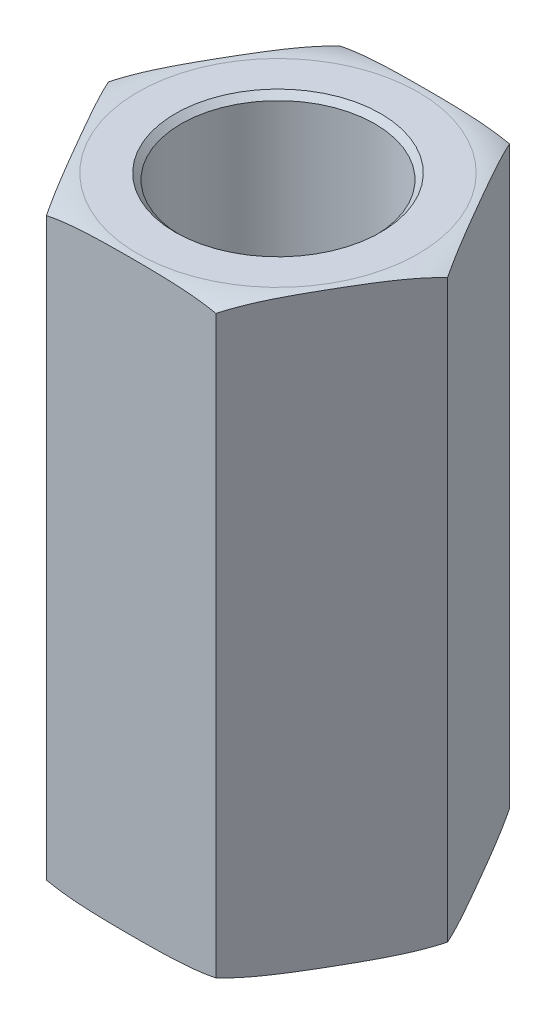
ISO-10303-21;
HEADER;
FILE_DESCRIPTION(('STEP AP214'),'2;1');
FILE_NAME('part.step','',(''),(''),'','','');
FILE_SCHEMA(('AUTOMOTIVE_DESIGN { 1 0 10303 214 1 1 1 1 }'));
ENDSEC;
DATA;
#1=APPLICATION_CONTEXT('core data for automotive mechanical design processes');
#2=APPLICATION_PROTOCOL_DEFINITION('international standard','automotive_design',2000,#1);
#3=PRODUCT_CONTEXT('',#1,'mechanical');
#4=PRODUCT('Part','Part','',(#3));
#5=PRODUCT_RELATED_PRODUCT_CATEGORY('part','',(#4));
#6=PRODUCT_DEFINITION_FORMATION('','',#4);
#7=PRODUCT_DEFINITION_CONTEXT('part definition',#1,'design');
#8=PRODUCT_DEFINITION('design','',#6,#7);
#9=PRODUCT_DEFINITION_SHAPE('','',#8);
#10=(LENGTH_UNIT() NAMED_UNIT(*) SI_UNIT(.MILLI.,.METRE.));
#11=(NAMED_UNIT(*) PLANE_ANGLE_UNIT() SI_UNIT($,.RADIAN.));
#12=(NAMED_UNIT(*) SI_UNIT($,.STERADIAN.) SOLID_ANGLE_UNIT());
#13=UNCERTAINTY_MEASURE_WITH_UNIT(LENGTH_MEASURE(1.E-05),#10,'distance_accuracy_value','');
#14=(GEOMETRIC_REPRESENTATION_CONTEXT(3) GLOBAL_UNCERTAINTY_ASSIGNED_CONTEXT((#13)) GLOBAL_UNIT_ASSIGNED_CONTEXT((#10,
#11,#12)) REPRESENTATION_CONTEXT('',''));
#15=CARTESIAN_POINT('',(0.,0.,0.));
#16=DIRECTION('',(0.,0.,1.));
#17=DIRECTION('',(1.,0.,0.));
#18=AXIS2_PLACEMENT_3D('',#15,#16,#17);
#19=CARTESIAN_POINT('',(3.66617420935412,6.35,0.));
#20=DIRECTION('',(-0.866025403784439,0.,-0.5));
#21=DIRECTION('',(0.5,0.,-0.866025403784439));
#22=AXIS2_PLACEMENT_3D('',#19,#20,#21);
#23=PLANE('',#22);
#24=CARTESIAN_POINT('',(3.66617420935412,6.223,0.));
#25=CARTESIAN_POINT('',(3.63753042799203,6.23493202468709,0.0496124846400273));
#26=CARTESIAN_POINT('',(3.60875945805375,6.24555614694223,0.0994452663561575));
#27=CARTESIAN_POINT('',(3.5510445941875,6.26452869380446,0.199410342924434));
#28=CARTESIAN_POINT('',(3.52210079717004,6.27287829008084,0.249542469922636));
#29=CARTESIAN_POINT('',(3.43520914920621,6.29501015084215,0.400043218949385));
#30=CARTESIAN_POINT('',(3.37708055050429,6.30592253839952,0.500724905273883));
#31=CARTESIAN_POINT('',(3.26070078255249,6.3225474670846,0.70230057633948));
#32=CARTESIAN_POINT('',(3.20244972255356,6.32826351393611,0.803194371852365));
#33=CARTESIAN_POINT('',(3.08586365366197,6.33654325238667,1.00512736662734));
#34=CARTESIAN_POINT('',(3.02752861562773,6.3391051045623,1.1061666163641));
#35=CARTESIAN_POINT('',(2.9113821383228,6.3424800878033,1.30733821617637));
#36=CARTESIAN_POINT('',(2.85357078573452,6.34330898530758,1.40747041611356));
#37=CARTESIAN_POINT('',(2.73795502274299,6.34390235146376,1.60772279177073));
#38=CARTESIAN_POINT('',(2.68015061252641,6.34366697200316,1.70784296716739));
#39=CARTESIAN_POINT('',(2.5645271384304,6.34193398748164,1.90810869884931));
#40=CARTESIAN_POINT('',(2.50670807591217,6.34043597123025,2.0082542527769));
#41=CARTESIAN_POINT('',(2.39109525560101,6.33517531674577,2.20850153156215));
#42=CARTESIAN_POINT('',(2.33330149587797,6.33141290136093,2.30860325976288));
#43=CARTESIAN_POINT('',(2.23849359853911,6.32198899303816,2.47281535491257));
#44=CARTESIAN_POINT('',(2.20145192539195,6.31749057663767,2.53697341480081));
#45=CARTESIAN_POINT('',(2.12747060706784,6.30630148199487,2.66511281694908));
#46=CARTESIAN_POINT('',(2.09053091530161,6.2996120720916,2.72909423990413));
#47=CARTESIAN_POINT('',(2.01669860633929,6.28339780386583,2.85697555026699));
#48=CARTESIAN_POINT('',(1.97980639337021,6.27386525006224,2.92087473753309));
#49=CARTESIAN_POINT('',(1.90623831426152,6.25126291445617,3.04829838836459));
#50=CARTESIAN_POINT('',(1.86956287153406,6.23818767878213,3.11182211855863));
#51=CARTESIAN_POINT('',(1.83308710467706,6.223,3.175));
#52=B_SPLINE_CURVE_WITH_KNOTS('',3,(#24,#25,#26,#27,#28,#29,#30,#31,#32,#33,#34,#35,#36,#37,#38,
#39,#40,#41,#42,#43,#44,#45,#46,#47,#48,#49,#50,#51),.UNSPECIFIED.,.F.,.F.,(4,2,2,2,2,2,2,2,2,2,
2,2,2,4),(0.,0.17550946738822,0.350928353443244,0.701031261588485,1.05089779629355,
1.40096826525493,1.74783967758032,2.09466158796882,2.44159648808704,2.78849725058545,
3.01113198199941,3.23363806003512,3.45675194236245,3.68021127402553),.UNSPECIFIED.);
#53=CARTESIAN_POINT('',(3.66617420935412,6.223,0.));
#54=VERTEX_POINT('',#53);
#55=CARTESIAN_POINT('',(1.83308710467706,6.223,3.175));
#56=VERTEX_POINT('',#55);
#57=EDGE_CURVE('E126',#54,#56,#52,.T.);
#58=ORIENTED_EDGE('',*,*,#57,.T.);
#59=DIRECTION('',(0.,1.,0.));
#60=VECTOR('',#59,1.);
#61=CARTESIAN_POINT('',(1.83308710467704,6.35,3.175));
#62=LINE('',#61,#60);
#63=CARTESIAN_POINT('',(1.83308710467705,-6.223,3.175));
#64=VERTEX_POINT('',#63);
#65=EDGE_CURVE('E130',#64,#56,#62,.T.);
#66=ORIENTED_EDGE('',*,*,#65,.F.);
#67=CARTESIAN_POINT('',(1.83308710467705,-6.223,3.17500000000001));
#68=CARTESIAN_POINT('',(1.86173088603914,-6.23493202468708,3.12538751535998));
#69=CARTESIAN_POINT('',(1.89050185597742,-6.24555614694223,3.07555473364384));
#70=CARTESIAN_POINT('',(1.94821671984368,-6.26452869380445,2.97558965707556));
#71=CARTESIAN_POINT('',(1.97716051686114,-6.27287829008084,2.92545753007736));
#72=CARTESIAN_POINT('',(2.06405216482497,-6.29501015084215,2.77495678105061));
#73=CARTESIAN_POINT('',(2.12218076352689,-6.30592253839952,2.67427509472611));
#74=CARTESIAN_POINT('',(2.2385605314787,-6.3225474670846,2.4726994236605));
#75=CARTESIAN_POINT('',(2.29681159147762,-6.32826351393611,2.37180562814761));
#76=CARTESIAN_POINT('',(2.41339766036922,-6.33654325238667,2.16987263337264));
#77=CARTESIAN_POINT('',(2.47173269840347,-6.3391051045623,2.06883338363586));
#78=CARTESIAN_POINT('',(2.58787917570839,-6.3424800878033,1.86766178382359));
#79=CARTESIAN_POINT('',(2.64569052829668,-6.34330898530758,1.7675295838864));
#80=CARTESIAN_POINT('',(2.76130629128821,-6.34390235146376,1.56727720822922));
#81=CARTESIAN_POINT('',(2.81911070150479,-6.34366697200316,1.46715703283255));
#82=CARTESIAN_POINT('',(2.93473417560081,-6.34193398748164,1.26689130115063));
#83=CARTESIAN_POINT('',(2.99255323811904,-6.34043597123025,1.16674574722304));
#84=CARTESIAN_POINT('',(3.1081660584302,-6.33517531674576,0.966498468437779));
#85=CARTESIAN_POINT('',(3.16595981815325,-6.33141290136092,0.866396740237043));
#86=CARTESIAN_POINT('',(3.26076771549211,-6.32198899303815,0.702184645087361));
#87=CARTESIAN_POINT('',(3.29780938863927,-6.31749057663767,0.638026585199124));
#88=CARTESIAN_POINT('',(3.37179070696336,-6.30630148199486,0.509887183050866));
#89=CARTESIAN_POINT('',(3.40873039872959,-6.2996120720916,0.445905760095823));
#90=CARTESIAN_POINT('',(3.4825627076919,-6.28339780386583,0.318024449732975));
#91=CARTESIAN_POINT('',(3.51945492066098,-6.27386525006224,0.254125262466882));
#92=CARTESIAN_POINT('',(3.59302299976966,-6.25126291445617,0.126701611635399));
#93=CARTESIAN_POINT('',(3.62969844249711,-6.23818767878213,0.0631778814413663));
#94=CARTESIAN_POINT('',(3.66617420935412,-6.223,0.));
#95=B_SPLINE_CURVE_WITH_KNOTS('',3,(#67,#68,#69,#70,#71,#72,#73,#74,#75,#76,#77,#78,#79,#80,#81,
#82,#83,#84,#85,#86,#87,#88,#89,#90,#91,#92,#93,#94),.UNSPECIFIED.,.F.,.F.,(4,2,2,2,2,2,2,2,2,2,
2,2,2,4),(0.,0.175509467388227,0.350928353443257,0.701031261588509,1.05089779629358,
1.40096826525498,1.74783967758038,2.09466158796889,2.44159648808712,2.78849725058554,
3.01113198199948,3.23363806003517,3.45675194236248,3.68021127402553),.UNSPECIFIED.);
#96=CARTESIAN_POINT('',(3.66617420935412,-6.223,0.));
#97=VERTEX_POINT('',#96);
#98=EDGE_CURVE('E115',#64,#97,#95,.T.);
#99=ORIENTED_EDGE('',*,*,#98,.T.);
#100=DIRECTION('',(0.,1.,0.));
#101=VECTOR('',#100,1.);
#102=CARTESIAN_POINT('',(3.66617420935412,6.35,0.));
#103=LINE('',#102,#101);
#104=EDGE_CURVE('E120',#54,#97,#103,.F.);
#105=ORIENTED_EDGE('',*,*,#104,.F.);
#106=EDGE_LOOP('',(#58,#66,#99,#105));
#107=FACE_BOUND('',#106,.T.);
#108=ADVANCED_FACE('F37',(#107),#23,.F.);
#109=CARTESIAN_POINT('',(1.83308710467706,6.35,-3.17499999999999));
#110=DIRECTION('',(-0.866025403784439,0.,0.5));
#111=DIRECTION('',(-0.5,0.,-0.866025403784439));
#112=AXIS2_PLACEMENT_3D('',#109,#110,#111);
#113=PLANE('',#112);
#114=CARTESIAN_POINT('',(1.83308710467706,6.223,-3.17499999999999));
#115=CARTESIAN_POINT('',(1.86173088603915,6.23493202468709,-3.12538751535996));
#116=CARTESIAN_POINT('',(1.89050185597743,6.24555614694223,-3.07555473364383));
#117=CARTESIAN_POINT('',(1.94821671984368,6.26452869380446,-2.97558965707556));
#118=CARTESIAN_POINT('',(1.97716051686114,6.27287829008084,-2.92545753007736));
#119=CARTESIAN_POINT('',(2.06405216482498,6.29501015084215,-2.77495678105061));
#120=CARTESIAN_POINT('',(2.12218076352689,6.30592253839952,-2.67427509472611));
#121=CARTESIAN_POINT('',(2.23856053147869,6.3225474670846,-2.47269942366051));
#122=CARTESIAN_POINT('',(2.29681159147762,6.32826351393611,-2.37180562814763));
#123=CARTESIAN_POINT('',(2.41339766036922,6.33654325238667,-2.16987263337266));
#124=CARTESIAN_POINT('',(2.47173269840346,6.3391051045623,-2.06883338363589));
#125=CARTESIAN_POINT('',(2.58787917570838,6.3424800878033,-1.86766178382362));
#126=CARTESIAN_POINT('',(2.64569052829666,6.34330898530758,-1.76752958388643));
#127=CARTESIAN_POINT('',(2.76130629128819,6.34390235146376,-1.56727720822926));
#128=CARTESIAN_POINT('',(2.81911070150477,6.34366697200316,-1.46715703283259));
#129=CARTESIAN_POINT('',(2.93473417560078,6.34193398748164,-1.26689130115068));
#130=CARTESIAN_POINT('',(2.99255323811902,6.34043597123025,-1.16674574722309));
#131=CARTESIAN_POINT('',(3.10816605843017,6.33517531674577,-0.966498468437838));
#132=CARTESIAN_POINT('',(3.16595981815321,6.33141290136093,-0.866396740237105));
#133=CARTESIAN_POINT('',(3.26076771549208,6.32198899303816,-0.702184645087422));
#134=CARTESIAN_POINT('',(3.29780938863924,6.31749057663767,-0.638026585199181));
#135=CARTESIAN_POINT('',(3.37179070696334,6.30630148199487,-0.509887183050912));
#136=CARTESIAN_POINT('',(3.40873039872957,6.2996120720916,-0.445905760095864));
#137=CARTESIAN_POINT('',(3.48256270769189,6.28339780386583,-0.318024449733006));
#138=CARTESIAN_POINT('',(3.51945492066097,6.27386525006224,-0.254125262466908));
#139=CARTESIAN_POINT('',(3.59302299976965,6.25126291445617,-0.126701611635414));
#140=CARTESIAN_POINT('',(3.62969844249711,6.23818767878213,-0.0631778814413764));
#141=CARTESIAN_POINT('',(3.66617420935412,6.223,0.));
#142=B_SPLINE_CURVE_WITH_KNOTS('',3,(#114,#115,#116,#117,#118,#119,#120,#121,#122,#123,#124,
#125,#126,#127,#128,#129,#130,#131,#132,#133,#134,#135,#136,#137,#138,#139,#140,#141),
.UNSPECIFIED.,.F.,.F.,(4,2,2,2,2,2,2,2,2,2,2,2,2,4),(0.,0.175509467388221,0.350928353443245,
0.701031261588486,1.05089779629355,1.40096826525493,1.74783967758032,2.09466158796882,
2.44159648808704,2.78849725058545,3.0111319819994,3.23363806003511,3.45675194236244,
3.68021127402551),.UNSPECIFIED.);
#143=CARTESIAN_POINT('',(1.83308710467706,6.223,-3.17499999999999));
#144=VERTEX_POINT('',#143);
#145=EDGE_CURVE('E42',#144,#54,#142,.T.);
#146=ORIENTED_EDGE('',*,*,#145,.T.);
#147=ORIENTED_EDGE('',*,*,#104,.T.);
#148=CARTESIAN_POINT('',(3.66617420935412,-6.223,0.));
#149=CARTESIAN_POINT('',(3.63753042799203,-6.23493202468709,-0.0496124846400355));
#150=CARTESIAN_POINT('',(3.60875945805375,-6.24555614694223,-0.0994452663561683));
#151=CARTESIAN_POINT('',(3.55104459418749,-6.26452869380446,-0.19941034292445));
#152=CARTESIAN_POINT('',(3.52210079717003,-6.27287829008084,-0.249542469922655));
#153=CARTESIAN_POINT('',(3.43520914920619,-6.29501015084215,-0.400043218949413));
#154=CARTESIAN_POINT('',(3.37708055050427,-6.30592253839952,-0.500724905273916));
#155=CARTESIAN_POINT('',(3.26070078255247,-6.3225474670846,-0.702300576339523));
#156=CARTESIAN_POINT('',(3.20244972255354,-6.32826351393611,-0.803194371852414));
#157=CARTESIAN_POINT('',(3.08586365366193,-6.33654325238667,-1.0051273666274));
#158=CARTESIAN_POINT('',(3.02752861562769,-6.3391051045623,-1.10616661636417));
#159=CARTESIAN_POINT('',(2.91138213832276,-6.3424800878033,-1.30733821617645));
#160=CARTESIAN_POINT('',(2.85357078573448,-6.34330898530758,-1.40747041611364));
#161=CARTESIAN_POINT('',(2.73795502274294,-6.34390235146376,-1.60772279177082));
#162=CARTESIAN_POINT('',(2.68015061252636,-6.34366697200316,-1.70784296716749));
#163=CARTESIAN_POINT('',(2.56452713843034,-6.34193398748164,-1.90810869884942));
#164=CARTESIAN_POINT('',(2.5067080759121,-6.34043597123025,-2.00825425277701));
#165=CARTESIAN_POINT('',(2.39109525560094,-6.33517531674576,-2.20850153156228));
#166=CARTESIAN_POINT('',(2.3333014958779,-6.33141290136092,-2.30860325976302));
#167=CARTESIAN_POINT('',(2.23849359853904,-6.32198899303815,-2.47281535491269));
#168=CARTESIAN_POINT('',(2.20145192539188,-6.31749057663766,-2.53697341480092));
#169=CARTESIAN_POINT('',(2.1274706070678,-6.30630148199486,-2.66511281694917));
#170=CARTESIAN_POINT('',(2.09053091530157,-6.29961207209159,-2.72909423990421));
#171=CARTESIAN_POINT('',(2.01669860633926,-6.28339780386582,-2.85697555026704));
#172=CARTESIAN_POINT('',(1.97980639337019,-6.27386525006223,-2.92087473753313));
#173=CARTESIAN_POINT('',(1.90623831426151,-6.25126291445617,-3.0482983883646));
#174=CARTESIAN_POINT('',(1.86956287153406,-6.23818767878213,-3.11182211855863));
#175=CARTESIAN_POINT('',(1.83308710467706,-6.223,-3.17499999999999));
#176=B_SPLINE_CURVE_WITH_KNOTS('',3,(#148,#149,#150,#151,#152,#153,#154,#155,#156,#157,#158,
#159,#160,#161,#162,#163,#164,#165,#166,#167,#168,#169,#170,#171,#172,#173,#174,#175),
.UNSPECIFIED.,.F.,.F.,(4,2,2,2,2,2,2,2,2,2,2,2,2,4),(0.,0.17550946738823,0.350928353443263,
0.701031261588523,1.0508977962936,1.40096826525501,1.74783967758041,2.09466158796894,
2.44159648808717,2.7884972505856,3.01113198199951,3.23363806003518,3.45675194236248,
3.68021127402551),.UNSPECIFIED.);
#177=CARTESIAN_POINT('',(1.83308710467706,-6.223,-3.17499999999999));
#178=VERTEX_POINT('',#177);
#179=EDGE_CURVE('E119',#97,#178,#176,.T.);
#180=ORIENTED_EDGE('',*,*,#179,.T.);
#181=DIRECTION('',(0.,1.,0.));
#182=VECTOR('',#181,1.);
#183=CARTESIAN_POINT('',(1.83308710467706,6.35,-3.17499999999999));
#184=LINE('',#183,#182);
#185=EDGE_CURVE('E109',#144,#178,#184,.F.);
#186=ORIENTED_EDGE('',*,*,#185,.F.);
#187=EDGE_LOOP('',(#146,#147,#180,#186));
#188=FACE_BOUND('',#187,.T.);
#189=ADVANCED_FACE('F118',(#188),#113,.F.);
#190=CARTESIAN_POINT('',(-1.83308710467707,6.35,-3.175));
#191=DIRECTION('',(0.,0.,1.));
#192=DIRECTION('',(-1.,0.,0.));
#193=AXIS2_PLACEMENT_3D('',#190,#191,#192);
#194=PLANE('',#193);
#195=ORIENTED_EDGE('',*,*,#185,.T.);
#196=CARTESIAN_POINT('',(1.83308710467706,-6.223,-3.17499999999999));
#197=CARTESIAN_POINT('',(1.75760871054776,-6.23871230122365,-3.17499999999999));
#198=CARTESIAN_POINT('',(1.68170571468658,-6.25216478008081,-3.17499999999999));
#199=CARTESIAN_POINT('',(1.52939807527773,-6.27530486470105,-3.17499999999999));
#200=CARTESIAN_POINT('',(1.45299400110163,-6.28499617502722,-3.17499999999999));
#201=CARTESIAN_POINT('',(1.30011823209763,-6.30137135267139,-3.17499999999999));
#202=CARTESIAN_POINT('',(1.22364747610196,-6.30806442247852,-3.17499999999999));
#203=CARTESIAN_POINT('',(1.07052459410172,-6.31917241699752,-3.17499999999999));
#204=CARTESIAN_POINT('',(0.993872424115954,-6.32358671655425,-3.17499999999999));
#205=CARTESIAN_POINT('',(0.840856910195844,-6.33072419802799,-3.17499999999999));
#206=CARTESIAN_POINT('',(0.76449391332928,-6.33345527367792,-3.17499999999999));
#207=CARTESIAN_POINT('',(0.611734616938515,-6.33775632258003,-3.17499999999999));
#208=CARTESIAN_POINT('',(0.535338316331408,-6.33932625473883,-3.17499999999999));
#209=CARTESIAN_POINT('',(0.382454231226419,-6.34168247076568,-3.17499999999999));
#210=CARTESIAN_POINT('',(0.305966435115038,-6.34246792759644,-3.17499999999999));
#211=CARTESIAN_POINT('',(0.152985759387012,-6.34348841069004,-3.17499999999999));
#212=CARTESIAN_POINT('',(0.0764928796935062,-6.3437234241492,-3.175));
#213=CARTESIAN_POINT('',(-0.076492879693506,-6.3437234241492,-3.175));
#214=CARTESIAN_POINT('',(-0.152985759387012,-6.34348841069004,-3.175));
#215=CARTESIAN_POINT('',(-0.305966435115038,-6.34246792759644,-3.175));
#216=CARTESIAN_POINT('',(-0.382454231226419,-6.34168247076568,-3.175));
#217=CARTESIAN_POINT('',(-0.535338316331408,-6.33932625473883,-3.175));
#218=CARTESIAN_POINT('',(-0.611734616938515,-6.33775632258003,-3.175));
#219=CARTESIAN_POINT('',(-0.76449391332928,-6.33345527367792,-3.175));
#220=CARTESIAN_POINT('',(-0.840856910195844,-6.33072419802798,-3.175));
#221=CARTESIAN_POINT('',(-0.993872424115955,-6.32358671655425,-3.175));
#222=CARTESIAN_POINT('',(-1.07052459410172,-6.31917241699752,-3.175));
#223=CARTESIAN_POINT('',(-1.22364747610196,-6.30806442247852,-3.175));
#224=CARTESIAN_POINT('',(-1.30011823209763,-6.30137135267139,-3.175));
#225=CARTESIAN_POINT('',(-1.45299400110163,-6.28499617502722,-3.175));
#226=CARTESIAN_POINT('',(-1.52939807527773,-6.27530486470105,-3.175));
#227=CARTESIAN_POINT('',(-1.68170571468658,-6.2521647800808,-3.175));
#228=CARTESIAN_POINT('',(-1.75760871054776,-6.23871230122365,-3.175));
#229=CARTESIAN_POINT('',(-1.83308710467706,-6.223,-3.175));
#230=B_SPLINE_CURVE_WITH_KNOTS('',3,(#196,#197,#198,#199,#200,#201,#202,#203,#204,#205,#206,
#207,#208,#209,#210,#211,#212,#213,#214,#215,#216,#217,#218,#219,#220,#221,#222,#223,#224,#225,
#226,#227,#228,#229),.UNSPECIFIED.,.F.,.F.,(4,2,2,2,2,2,2,2,2,2,2,2,2,2,2,2,4),(0.,
0.23119079437731,0.462153295935889,0.692401964780502,0.92271376624805,1.15193709952407,
1.3811685447265,1.61064140410055,1.84011960111016,2.06959779811977,2.29907065749383,
2.52830210269625,2.75752543597227,2.98783723743982,3.21808590628443,3.44904840784301,
3.68023920222032),.UNSPECIFIED.);
#231=CARTESIAN_POINT('',(-1.83308710467707,-6.223,-3.175));
#232=VERTEX_POINT('',#231);
#233=EDGE_CURVE('E218',#178,#232,#230,.T.);
#234=ORIENTED_EDGE('',*,*,#233,.T.);
#235=DIRECTION('',(0.,1.,0.));
#236=VECTOR('',#235,1.);
#237=CARTESIAN_POINT('',(-1.83308710467707,6.35,-3.175));
#238=LINE('',#237,#236);
#239=CARTESIAN_POINT('',(-1.83308710467707,6.223,-3.175));
#240=VERTEX_POINT('',#239);
#241=EDGE_CURVE('E112',#240,#232,#238,.F.);
#242=ORIENTED_EDGE('',*,*,#241,.F.);
#243=CARTESIAN_POINT('',(-1.83308710467707,6.223,-3.175));
#244=CARTESIAN_POINT('',(-1.75760871054776,6.23871230122365,-3.175));
#245=CARTESIAN_POINT('',(-1.68170571468658,6.2521647800808,-3.175));
#246=CARTESIAN_POINT('',(-1.52939807527773,6.27530486470105,-3.175));
#247=CARTESIAN_POINT('',(-1.45299400110163,6.28499617502722,-3.175));
#248=CARTESIAN_POINT('',(-1.30011823209763,6.30137135267138,-3.175));
#249=CARTESIAN_POINT('',(-1.22364747610196,6.30806442247852,-3.175));
#250=CARTESIAN_POINT('',(-1.07052459410173,6.31917241699752,-3.175));
#251=CARTESIAN_POINT('',(-0.993872424115957,6.32358671655425,-3.175));
#252=CARTESIAN_POINT('',(-0.840856910195846,6.33072419802798,-3.175));
#253=CARTESIAN_POINT('',(-0.764493913329282,6.33345527367792,-3.175));
#254=CARTESIAN_POINT('',(-0.611734616938516,6.33775632258003,-3.175));
#255=CARTESIAN_POINT('',(-0.535338316331409,6.33932625473883,-3.175));
#256=CARTESIAN_POINT('',(-0.38245423122642,6.34168247076567,-3.175));
#257=CARTESIAN_POINT('',(-0.305966435115039,6.34246792759644,-3.175));
#258=CARTESIAN_POINT('',(-0.152985759387013,6.34348841069004,-3.175));
#259=CARTESIAN_POINT('',(-0.0764928796935063,6.3437234241492,-3.175));
#260=CARTESIAN_POINT('',(0.0764928796935061,6.3437234241492,-3.175));
#261=CARTESIAN_POINT('',(0.152985759387012,6.34348841069004,-3.17499999999999));
#262=CARTESIAN_POINT('',(0.305966435115038,6.34246792759644,-3.17499999999999));
#263=CARTESIAN_POINT('',(0.382454231226419,6.34168247076567,-3.17499999999999));
#264=CARTESIAN_POINT('',(0.535338316331408,6.33932625473883,-3.17499999999999));
#265=CARTESIAN_POINT('',(0.611734616938515,6.33775632258003,-3.17499999999999));
#266=CARTESIAN_POINT('',(0.76449391332928,6.33345527367792,-3.17499999999999));
#267=CARTESIAN_POINT('',(0.840856910195844,6.33072419802798,-3.17499999999999));
#268=CARTESIAN_POINT('',(0.993872424115954,6.32358671655425,-3.17499999999999));
#269=CARTESIAN_POINT('',(1.07052459410172,6.31917241699752,-3.17499999999999));
#270=CARTESIAN_POINT('',(1.22364747610196,6.30806442247852,-3.17499999999999));
#271=CARTESIAN_POINT('',(1.30011823209763,6.30137135267139,-3.17499999999999));
#272=CARTESIAN_POINT('',(1.45299400110163,6.28499617502722,-3.17499999999999));
#273=CARTESIAN_POINT('',(1.52939807527773,6.27530486470105,-3.17499999999999));
#274=CARTESIAN_POINT('',(1.68170571468658,6.25216478008081,-3.17499999999999));
#275=CARTESIAN_POINT('',(1.75760871054776,6.23871230122365,-3.17499999999999));
#276=CARTESIAN_POINT('',(1.83308710467706,6.223,-3.17499999999999));
#277=B_SPLINE_CURVE_WITH_KNOTS('',3,(#243,#244,#245,#246,#247,#248,#249,#250,#251,#252,#253,
#254,#255,#256,#257,#258,#259,#260,#261,#262,#263,#264,#265,#266,#267,#268,#269,#270,#271,#272,
#273,#274,#275,#276),.UNSPECIFIED.,.F.,.F.,(4,2,2,2,2,2,2,2,2,2,2,2,2,2,2,2,4),(0.,
0.23119079437731,0.46215329593589,0.692401964780505,0.922713766248053,1.15193709952408,
1.3811685447265,1.61064140410055,1.84011960111017,2.06959779811978,2.29907065749383,
2.52830210269625,2.75752543597228,2.98783723743982,3.21808590628444,3.44904840784302,
3.68023920222033),.UNSPECIFIED.);
#278=EDGE_CURVE('E106',#240,#144,#277,.T.);
#279=ORIENTED_EDGE('',*,*,#278,.T.);
#280=EDGE_LOOP('',(#195,#234,#242,#279));
#281=FACE_BOUND('',#280,.T.);
#282=ADVANCED_FACE('F107',(#281),#194,.F.);
#283=CARTESIAN_POINT('',(-3.66617420935413,6.35,0.));
#284=DIRECTION('',(0.866025403784439,0.,0.499999999999999));
#285=DIRECTION('',(-0.499999999999999,0.,0.866025403784439));
#286=AXIS2_PLACEMENT_3D('',#283,#284,#285);
#287=PLANE('',#286);
#288=CARTESIAN_POINT('',(-3.66617420935412,6.223,0.));
#289=CARTESIAN_POINT('',(-3.63753042799204,6.23493202468708,-0.0496124846400287));
#290=CARTESIAN_POINT('',(-3.60875945805376,6.24555614694223,-0.0994452663561603));
#291=CARTESIAN_POINT('',(-3.5510445941875,6.26452869380446,-0.199410342924439));
#292=CARTESIAN_POINT('',(-3.52210079717004,6.27287829008084,-0.249542469922643));
#293=CARTESIAN_POINT('',(-3.43520914920621,6.29501015084215,-0.400043218949397));
#294=CARTESIAN_POINT('',(-3.37708055050429,6.30592253839952,-0.500724905273897));
#295=CARTESIAN_POINT('',(-3.26070078255249,6.3225474670846,-0.702300576339499));
#296=CARTESIAN_POINT('',(-3.20244972255356,6.32826351393611,-0.803194371852387));
#297=CARTESIAN_POINT('',(-3.08586365366196,6.33654325238667,-1.00512736662736));
#298=CARTESIAN_POINT('',(-3.02752861562771,6.3391051045623,-1.10616661636413));
#299=CARTESIAN_POINT('',(-2.91138213832279,6.3424800878033,-1.30733821617641));
#300=CARTESIAN_POINT('',(-2.85357078573451,6.34330898530758,-1.4074704161136));
#301=CARTESIAN_POINT('',(-2.73795502274297,6.34390235146376,-1.60772279177078));
#302=CARTESIAN_POINT('',(-2.68015061252639,6.34366697200316,-1.70784296716744));
#303=CARTESIAN_POINT('',(-2.56452713843038,6.34193398748164,-1.90810869884937));
#304=CARTESIAN_POINT('',(-2.50670807591214,6.34043597123025,-2.00825425277695));
#305=CARTESIAN_POINT('',(-2.39109525560098,6.33517531674576,-2.20850153156221));
#306=CARTESIAN_POINT('',(-2.33330149587794,6.33141290136092,-2.30860325976295));
#307=CARTESIAN_POINT('',(-2.23849359853908,6.32198899303815,-2.47281535491263));
#308=CARTESIAN_POINT('',(-2.20145192539192,6.31749057663767,-2.53697341480087));
#309=CARTESIAN_POINT('',(-2.12747060706783,6.30630148199486,-2.66511281694913));
#310=CARTESIAN_POINT('',(-2.0905309153016,6.2996120720916,-2.72909423990417));
#311=CARTESIAN_POINT('',(-2.01669860633929,6.28339780386583,-2.85697555026702));
#312=CARTESIAN_POINT('',(-1.97980639337021,6.27386525006224,-2.92087473753311));
#313=CARTESIAN_POINT('',(-1.90623831426153,6.25126291445617,-3.0482983883646));
#314=CARTESIAN_POINT('',(-1.86956287153407,6.23818767878213,-3.11182211855863));
#315=CARTESIAN_POINT('',(-1.83308710467707,6.223,-3.175));
#316=B_SPLINE_CURVE_WITH_KNOTS('',3,(#288,#289,#290,#291,#292,#293,#294,#295,#296,#297,#298,
#299,#300,#301,#302,#303,#304,#305,#306,#307,#308,#309,#310,#311,#312,#313,#314,#315),
.UNSPECIFIED.,.F.,.F.,(4,2,2,2,2,2,2,2,2,2,2,2,2,4),(0.,0.175509467388225,0.350928353443254,
0.701031261588504,1.05089779629357,1.40096826525497,1.74783967758037,2.09466158796888,
2.44159648808711,2.78849725058552,3.01113198199946,3.23363806003515,3.45675194236247,
3.68021127402552),.UNSPECIFIED.);
#317=CARTESIAN_POINT('',(-3.66617420935413,6.223,0.));
#318=VERTEX_POINT('',#317);
#319=EDGE_CURVE('E116',#318,#240,#316,.T.);
#320=ORIENTED_EDGE('',*,*,#319,.T.);
#321=ORIENTED_EDGE('',*,*,#241,.T.);
#322=CARTESIAN_POINT('',(-1.83308710467707,-6.223,-3.175));
#323=CARTESIAN_POINT('',(-1.86173088603915,-6.23493202468708,-3.12538751535997));
#324=CARTESIAN_POINT('',(-1.89050185597743,-6.24555614694223,-3.07555473364384));
#325=CARTESIAN_POINT('',(-1.94821671984368,-6.26452869380445,-2.97558965707557));
#326=CARTESIAN_POINT('',(-1.97716051686114,-6.27287829008083,-2.92545753007737));
#327=CARTESIAN_POINT('',(-2.06405216482498,-6.29501015084215,-2.77495678105062));
#328=CARTESIAN_POINT('',(-2.12218076352689,-6.30592253839952,-2.67427509472613));
#329=CARTESIAN_POINT('',(-2.23856053147869,-6.3225474670846,-2.47269942366053));
#330=CARTESIAN_POINT('',(-2.29681159147761,-6.32826351393611,-2.37180562814765));
#331=CARTESIAN_POINT('',(-2.41339766036921,-6.33654325238667,-2.16987263337269));
#332=CARTESIAN_POINT('',(-2.47173269840345,-6.3391051045623,-2.06883338363592));
#333=CARTESIAN_POINT('',(-2.58787917570836,-6.3424800878033,-1.86766178382365));
#334=CARTESIAN_POINT('',(-2.64569052829664,-6.34330898530758,-1.76752958388647));
#335=CARTESIAN_POINT('',(-2.76130629128817,-6.34390235146376,-1.5672772082293));
#336=CARTESIAN_POINT('',(-2.81911070150475,-6.34366697200316,-1.46715703283264));
#337=CARTESIAN_POINT('',(-2.93473417560076,-6.34193398748164,-1.26689130115073));
#338=CARTESIAN_POINT('',(-2.99255323811899,-6.34043597123025,-1.16674574722315));
#339=CARTESIAN_POINT('',(-3.10816605843015,-6.33517531674577,-0.966498468437894));
#340=CARTESIAN_POINT('',(-3.16595981815318,-6.33141290136093,-0.866396740237163));
#341=CARTESIAN_POINT('',(-3.26076771549205,-6.32198899303816,-0.702184645087477));
#342=CARTESIAN_POINT('',(-3.29780938863921,-6.31749057663768,-0.63802658519923));
#343=CARTESIAN_POINT('',(-3.37179070696332,-6.30630148199487,-0.509887183050951));
#344=CARTESIAN_POINT('',(-3.40873039872955,-6.29961207209161,-0.445905760095898));
#345=CARTESIAN_POINT('',(-3.48256270769188,-6.28339780386583,-0.318024449733029));
#346=CARTESIAN_POINT('',(-3.51945492066096,-6.27386525006224,-0.254125262466926));
#347=CARTESIAN_POINT('',(-3.59302299976965,-6.25126291445617,-0.126701611635421));
#348=CARTESIAN_POINT('',(-3.62969844249711,-6.23818767878213,-0.0631778814413781));
#349=CARTESIAN_POINT('',(-3.66617420935412,-6.223,0.));
#350=B_SPLINE_CURVE_WITH_KNOTS('',3,(#322,#323,#324,#325,#326,#327,#328,#329,#330,#331,#332,
#333,#334,#335,#336,#337,#338,#339,#340,#341,#342,#343,#344,#345,#346,#347,#348,#349),
.UNSPECIFIED.,.F.,.F.,(4,2,2,2,2,2,2,2,2,2,2,2,2,4),(0.,0.175509467388216,0.350928353443237,
0.701031261588471,1.05089779629352,1.4009682652549,1.74783967758028,2.09466158796878,
2.44159648808698,2.78849725058539,3.01113198199936,3.23363806003508,3.45675194236244,
3.68021127402552),.UNSPECIFIED.);
#351=CARTESIAN_POINT('',(-3.66617420935413,-6.223,0.));
#352=VERTEX_POINT('',#351);
#353=EDGE_CURVE('E212',#232,#352,#350,.T.);
#354=ORIENTED_EDGE('',*,*,#353,.T.);
#355=DIRECTION('',(0.,1.,0.));
#356=VECTOR('',#355,1.);
#357=CARTESIAN_POINT('',(-3.66617420935413,6.35,0.));
#358=LINE('',#357,#356);
#359=EDGE_CURVE('E136',#318,#352,#358,.F.);
#360=ORIENTED_EDGE('',*,*,#359,.F.);
#361=EDGE_LOOP('',(#320,#321,#354,#360));
#362=FACE_BOUND('',#361,.T.);
#363=ADVANCED_FACE('F206',(#362),#287,.F.);
#364=CARTESIAN_POINT('',(-1.83308710467707,6.35,3.175));
#365=DIRECTION('',(0.866025403784439,0.,-0.5));
#366=DIRECTION('',(0.5,0.,0.866025403784439));
#367=AXIS2_PLACEMENT_3D('',#364,#365,#366);
#368=PLANE('',#367);
#369=CARTESIAN_POINT('',(-1.83308710467706,6.223,3.17500000000001));
#370=CARTESIAN_POINT('',(-1.86173088603915,6.23493202468708,3.12538751535998));
#371=CARTESIAN_POINT('',(-1.89050185597743,6.24555614694223,3.07555473364385));
#372=CARTESIAN_POINT('',(-1.94821671984368,6.26452869380445,2.97558965707557));
#373=CARTESIAN_POINT('',(-1.97716051686114,6.27287829008083,2.92545753007737));
#374=CARTESIAN_POINT('',(-2.06405216482498,6.29501015084215,2.77495678105062));
#375=CARTESIAN_POINT('',(-2.12218076352689,6.30592253839952,2.67427509472612));
#376=CARTESIAN_POINT('',(-2.2385605314787,6.3225474670846,2.47269942366052));
#377=CARTESIAN_POINT('',(-2.29681159147762,6.32826351393611,2.37180562814763));
#378=CARTESIAN_POINT('',(-2.41339766036922,6.33654325238667,2.16987263337266));
#379=CARTESIAN_POINT('',(-2.47173269840346,6.3391051045623,2.06883338363589));
#380=CARTESIAN_POINT('',(-2.58787917570839,6.3424800878033,1.86766178382362));
#381=CARTESIAN_POINT('',(-2.64569052829667,6.34330898530758,1.76752958388643));
#382=CARTESIAN_POINT('',(-2.7613062912882,6.34390235146376,1.56727720822926));
#383=CARTESIAN_POINT('',(-2.81911070150478,6.34366697200316,1.46715703283259));
#384=CARTESIAN_POINT('',(-2.93473417560079,6.34193398748164,1.26689130115067));
#385=CARTESIAN_POINT('',(-2.99255323811903,6.34043597123025,1.16674574722309));
#386=CARTESIAN_POINT('',(-3.10816605843019,6.33517531674577,0.966498468437829));
#387=CARTESIAN_POINT('',(-3.16595981815323,6.33141290136093,0.866396740237095));
#388=CARTESIAN_POINT('',(-3.26076771549209,6.32198899303815,0.702184645087411));
#389=CARTESIAN_POINT('',(-3.29780938863925,6.31749057663767,0.63802658519917));
#390=CARTESIAN_POINT('',(-3.37179070696335,6.30630148199487,0.509887183050903));
#391=CARTESIAN_POINT('',(-3.40873039872958,6.2996120720916,0.445905760095856));
#392=CARTESIAN_POINT('',(-3.4825627076919,6.28339780386583,0.318024449733));
#393=CARTESIAN_POINT('',(-3.51945492066098,6.27386525006224,0.254125262466903));
#394=CARTESIAN_POINT('',(-3.59302299976966,6.25126291445617,0.126701611635411));
#395=CARTESIAN_POINT('',(-3.62969844249712,6.23818767878213,0.0631778814413743));
#396=CARTESIAN_POINT('',(-3.66617420935413,6.223,0.));
#397=B_SPLINE_CURVE_WITH_KNOTS('',3,(#369,#370,#371,#372,#373,#374,#375,#376,#377,#378,#379,
#380,#381,#382,#383,#384,#385,#386,#387,#388,#389,#390,#391,#392,#393,#394,#395,#396),
.UNSPECIFIED.,.F.,.F.,(4,2,2,2,2,2,2,2,2,2,2,2,2,4),(0.,0.175509467388222,0.350928353443249,
0.701031261588494,1.05089779629356,1.40096826525495,1.74783967758034,2.09466158796885,
2.44159648808707,2.78849725058548,3.01113198199943,3.23363806003514,3.45675194236247,
3.68021127402553),.UNSPECIFIED.);
#398=CARTESIAN_POINT('',(-1.83308710467706,6.223,3.175));
#399=VERTEX_POINT('',#398);
#400=EDGE_CURVE('E182',#399,#318,#397,.T.);
#401=ORIENTED_EDGE('',*,*,#400,.T.);
#402=ORIENTED_EDGE('',*,*,#359,.T.);
#403=CARTESIAN_POINT('',(-3.66617420935413,-6.223,0.));
#404=CARTESIAN_POINT('',(-3.63753042799204,-6.23493202468708,0.049612484640031));
#405=CARTESIAN_POINT('',(-3.60875945805377,-6.24555614694223,0.0994452663561602));
#406=CARTESIAN_POINT('',(-3.55104459418751,-6.26452869380445,0.199410342924434));
#407=CARTESIAN_POINT('',(-3.52210079717005,-6.27287829008083,0.249542469922636));
#408=CARTESIAN_POINT('',(-3.43520914920622,-6.29501015084215,0.400043218949382));
#409=CARTESIAN_POINT('',(-3.37708055050431,-6.30592253839952,0.500724905273878));
#410=CARTESIAN_POINT('',(-3.26070078255251,-6.3225474670846,0.70230057633947));
#411=CARTESIAN_POINT('',(-3.20244972255358,-6.32826351393611,0.803194371852353));
#412=CARTESIAN_POINT('',(-3.08586365366199,-6.33654325238667,1.00512736662732));
#413=CARTESIAN_POINT('',(-3.02752861562775,-6.3391051045623,1.10616661636409));
#414=CARTESIAN_POINT('',(-2.91138213832283,-6.3424800878033,1.30733821617635));
#415=CARTESIAN_POINT('',(-2.85357078573455,-6.34330898530758,1.40747041611353));
#416=CARTESIAN_POINT('',(-2.73795502274302,-6.34390235146376,1.6077227917707));
#417=CARTESIAN_POINT('',(-2.68015061252644,-6.34366697200316,1.70784296716737));
#418=CARTESIAN_POINT('',(-2.56452713843043,-6.34193398748164,1.90810869884928));
#419=CARTESIAN_POINT('',(-2.5067080759122,-6.34043597123025,2.00825425277686));
#420=CARTESIAN_POINT('',(-2.39109525560104,-6.33517531674577,2.20850153156211));
#421=CARTESIAN_POINT('',(-2.333301495878,-6.33141290136093,2.30860325976284));
#422=CARTESIAN_POINT('',(-2.23849359853914,-6.32198899303816,2.47281535491253));
#423=CARTESIAN_POINT('',(-2.20145192539198,-6.31749057663768,2.53697341480078));
#424=CARTESIAN_POINT('',(-2.12747060706787,-6.30630148199487,2.66511281694906));
#425=CARTESIAN_POINT('',(-2.09053091530164,-6.29961207209161,2.72909423990411));
#426=CARTESIAN_POINT('',(-2.01669860633931,-6.28339780386583,2.85697555026698));
#427=CARTESIAN_POINT('',(-1.97980639337023,-6.27386525006224,2.92087473753308));
#428=CARTESIAN_POINT('',(-1.90623831426154,-6.25126291445617,3.04829838836458));
#429=CARTESIAN_POINT('',(-1.86956287153408,-6.23818767878213,3.11182211855862));
#430=CARTESIAN_POINT('',(-1.83308710467707,-6.223,3.175));
#431=B_SPLINE_CURVE_WITH_KNOTS('',3,(#403,#404,#405,#406,#407,#408,#409,#410,#411,#412,#413,
#414,#415,#416,#417,#418,#419,#420,#421,#422,#423,#424,#425,#426,#427,#428,#429,#430),
.UNSPECIFIED.,.F.,.F.,(4,2,2,2,2,2,2,2,2,2,2,2,2,4),(0.,0.175509467388217,0.350928353443238,
0.701031261588472,1.05089779629353,1.40096826525491,1.74783967758028,2.09466158796878,
2.44159648808699,2.78849725058539,3.01113198199936,3.23363806003509,3.45675194236244,
3.68021127402552),.UNSPECIFIED.);
#432=CARTESIAN_POINT('',(-1.83308710467707,-6.223,3.175));
#433=VERTEX_POINT('',#432);
#434=EDGE_CURVE('E160',#352,#433,#431,.T.);
#435=ORIENTED_EDGE('',*,*,#434,.T.);
#436=DIRECTION('',(0.,1.,0.));
#437=VECTOR('',#436,1.);
#438=CARTESIAN_POINT('',(-1.83308710467706,6.35,3.175));
#439=LINE('',#438,#437);
#440=EDGE_CURVE('E127',#399,#433,#439,.F.);
#441=ORIENTED_EDGE('',*,*,#440,.F.);
#442=EDGE_LOOP('',(#401,#402,#435,#441));
#443=FACE_BOUND('',#442,.T.);
#444=ADVANCED_FACE('F170',(#443),#368,.F.);
#445=CARTESIAN_POINT('',(1.83308710467706,6.35,3.175));
#446=DIRECTION('',(0.,0.,-1.));
#447=DIRECTION('',(1.,0.,0.));
#448=AXIS2_PLACEMENT_3D('',#445,#446,#447);
#449=PLANE('',#448);
#450=CARTESIAN_POINT('',(1.83308710467706,6.223,3.175));
#451=CARTESIAN_POINT('',(1.75760871054775,6.23871230122365,3.175));
#452=CARTESIAN_POINT('',(1.68170571468657,6.2521647800808,3.175));
#453=CARTESIAN_POINT('',(1.52939807527772,6.27530486470105,3.175));
#454=CARTESIAN_POINT('',(1.45299400110162,6.28499617502722,3.175));
#455=CARTESIAN_POINT('',(1.30011823209763,6.30137135267138,3.175));
#456=CARTESIAN_POINT('',(1.22364747610195,6.30806442247852,3.175));
#457=CARTESIAN_POINT('',(1.07052459410172,6.31917241699751,3.175));
#458=CARTESIAN_POINT('',(0.99387242411595,6.32358671655425,3.175));
#459=CARTESIAN_POINT('',(0.840856910195841,6.33072419802798,3.175));
#460=CARTESIAN_POINT('',(0.764493913329277,6.33345527367791,3.175));
#461=CARTESIAN_POINT('',(0.611734616938512,6.33775632258003,3.175));
#462=CARTESIAN_POINT('',(0.535338316331406,6.33932625473883,3.175));
#463=CARTESIAN_POINT('',(0.382454231226418,6.34168247076567,3.175));
#464=CARTESIAN_POINT('',(0.305966435115037,6.34246792759644,3.175));
#465=CARTESIAN_POINT('',(0.152985759387012,6.34348841069004,3.175));
#466=CARTESIAN_POINT('',(0.0764928796935061,6.3437234241492,3.175));
#467=CARTESIAN_POINT('',(-0.0764928796935053,6.3437234241492,3.175));
#468=CARTESIAN_POINT('',(-0.152985759387011,6.34348841069004,3.175));
#469=CARTESIAN_POINT('',(-0.305966435115036,6.34246792759644,3.175));
#470=CARTESIAN_POINT('',(-0.382454231226417,6.34168247076567,3.175));
#471=CARTESIAN_POINT('',(-0.535338316331405,6.33932625473883,3.175));
#472=CARTESIAN_POINT('',(-0.611734616938511,6.33775632258003,3.175));
#473=CARTESIAN_POINT('',(-0.764493913329276,6.33345527367791,3.175));
#474=CARTESIAN_POINT('',(-0.84085691019584,6.33072419802798,3.175));
#475=CARTESIAN_POINT('',(-0.99387242411595,6.32358671655425,3.175));
#476=CARTESIAN_POINT('',(-1.07052459410172,6.31917241699751,3.175));
#477=CARTESIAN_POINT('',(-1.22364747610195,6.30806442247852,3.175));
#478=CARTESIAN_POINT('',(-1.30011823209763,6.30137135267138,3.175));
#479=CARTESIAN_POINT('',(-1.45299400110163,6.28499617502722,3.175));
#480=CARTESIAN_POINT('',(-1.52939807527772,6.27530486470105,3.175));
#481=CARTESIAN_POINT('',(-1.68170571468657,6.2521647800808,3.175));
#482=CARTESIAN_POINT('',(-1.75760871054775,6.23871230122365,3.175));
#483=CARTESIAN_POINT('',(-1.83308710467706,6.223,3.175));
#484=B_SPLINE_CURVE_WITH_KNOTS('',3,(#450,#451,#452,#453,#454,#455,#456,#457,#458,#459,#460,
#461,#462,#463,#464,#465,#466,#467,#468,#469,#470,#471,#472,#473,#474,#475,#476,#477,#478,#479,
#480,#481,#482,#483),.UNSPECIFIED.,.F.,.F.,(4,2,2,2,2,2,2,2,2,2,2,2,2,2,2,2,4),(0.,
0.231190794377309,0.462153295935887,0.6924019647805,0.922713766248047,1.15193709952407,
1.38116854472649,1.61064140410054,1.84011960111015,2.06959779811976,2.29907065749382,
2.52830210269624,2.75752543597226,2.98783723743981,3.21808590628442,3.449048407843,
3.68023920222031),.UNSPECIFIED.);
#485=EDGE_CURVE('E128',#56,#399,#484,.T.);
#486=ORIENTED_EDGE('',*,*,#485,.T.);
#487=ORIENTED_EDGE('',*,*,#440,.T.);
#488=CARTESIAN_POINT('',(-1.83308710467707,-6.22299999999999,3.175));
#489=CARTESIAN_POINT('',(-1.75760871054776,-6.23871230122365,3.175));
#490=CARTESIAN_POINT('',(-1.68170571468658,-6.2521647800808,3.175));
#491=CARTESIAN_POINT('',(-1.52939807527773,-6.27530486470104,3.175));
#492=CARTESIAN_POINT('',(-1.45299400110163,-6.28499617502722,3.175));
#493=CARTESIAN_POINT('',(-1.30011823209763,-6.30137135267138,3.175));
#494=CARTESIAN_POINT('',(-1.22364747610196,-6.30806442247852,3.175));
#495=CARTESIAN_POINT('',(-1.07052459410173,-6.31917241699751,3.175));
#496=CARTESIAN_POINT('',(-0.993872424115956,-6.32358671655425,3.175));
#497=CARTESIAN_POINT('',(-0.840856910195845,-6.33072419802798,3.175));
#498=CARTESIAN_POINT('',(-0.764493913329281,-6.33345527367792,3.175));
#499=CARTESIAN_POINT('',(-0.611734616938516,-6.33775632258003,3.175));
#500=CARTESIAN_POINT('',(-0.535338316331409,-6.33932625473883,3.175));
#501=CARTESIAN_POINT('',(-0.38245423122642,-6.34168247076567,3.175));
#502=CARTESIAN_POINT('',(-0.305966435115039,-6.34246792759644,3.175));
#503=CARTESIAN_POINT('',(-0.152985759387013,-6.34348841069004,3.175));
#504=CARTESIAN_POINT('',(-0.0764928796935066,-6.3437234241492,3.175));
#505=CARTESIAN_POINT('',(0.0764928796935049,-6.3437234241492,3.175));
#506=CARTESIAN_POINT('',(0.15298575938701,-6.34348841069004,3.175));
#507=CARTESIAN_POINT('',(0.305966435115035,-6.34246792759644,3.175));
#508=CARTESIAN_POINT('',(0.382454231226416,-6.34168247076567,3.175));
#509=CARTESIAN_POINT('',(0.535338316331403,-6.33932625473883,3.175));
#510=CARTESIAN_POINT('',(0.611734616938509,-6.33775632258003,3.175));
#511=CARTESIAN_POINT('',(0.764493913329273,-6.33345527367792,3.175));
#512=CARTESIAN_POINT('',(0.840856910195836,-6.33072419802798,3.175));
#513=CARTESIAN_POINT('',(0.993872424115945,-6.32358671655425,3.175));
#514=CARTESIAN_POINT('',(1.07052459410171,-6.31917241699752,3.175));
#515=CARTESIAN_POINT('',(1.22364747610195,-6.30806442247852,3.175));
#516=CARTESIAN_POINT('',(1.30011823209762,-6.30137135267138,3.175));
#517=CARTESIAN_POINT('',(1.45299400110162,-6.28499617502722,3.175));
#518=CARTESIAN_POINT('',(1.52939807527771,-6.27530486470105,3.175));
#519=CARTESIAN_POINT('',(1.68170571468656,-6.25216478008081,3.175));
#520=CARTESIAN_POINT('',(1.75760871054774,-6.23871230122365,3.175));
#521=CARTESIAN_POINT('',(1.83308710467705,-6.223,3.175));
#522=B_SPLINE_CURVE_WITH_KNOTS('',3,(#488,#489,#490,#491,#492,#493,#494,#495,#496,#497,#498,
#499,#500,#501,#502,#503,#504,#505,#506,#507,#508,#509,#510,#511,#512,#513,#514,#515,#516,#517,
#518,#519,#520,#521),.UNSPECIFIED.,.F.,.F.,(4,2,2,2,2,2,2,2,2,2,2,2,2,2,2,2,4),(0.,
0.23119079437731,0.46215329593589,0.692401964780504,0.922713766248052,1.15193709952407,
1.3811685447265,1.61064140410055,1.84011960111016,2.06959779811977,2.29907065749383,
2.52830210269625,2.75752543597227,2.98783723743981,3.21808590628442,3.449048407843,
3.68023920222031),.UNSPECIFIED.);
#523=EDGE_CURVE('E154',#433,#64,#522,.T.);
#524=ORIENTED_EDGE('',*,*,#523,.T.);
#525=ORIENTED_EDGE('',*,*,#65,.T.);
#526=EDGE_LOOP('',(#486,#487,#524,#525));
#527=FACE_BOUND('',#526,.T.);
#528=ADVANCED_FACE('F166',(#527),#449,.F.);
#529=CARTESIAN_POINT('',(0.,4.69899999999995,0.));
#530=DIRECTION('',(0.,1.,0.));
#531=DIRECTION('',(0.,0.,-1.));
#532=AXIS2_PLACEMENT_3D('',#529,#530,#531);
#533=TOROIDAL_SURFACE('',#532,3.03117420935412,1.65100000000005);
#534=ORIENTED_EDGE('',*,*,#57,.F.);
#535=ORIENTED_EDGE('',*,*,#145,.F.);
#536=ORIENTED_EDGE('',*,*,#278,.F.);
#537=ORIENTED_EDGE('',*,*,#319,.F.);
#538=ORIENTED_EDGE('',*,*,#400,.F.);
#539=ORIENTED_EDGE('',*,*,#485,.F.);
#540=EDGE_LOOP('',(#534,#535,#536,#537,#538,#539));
#541=FACE_BOUND('',#540,.T.);
#542=CARTESIAN_POINT('',(0.,6.35,0.));
#543=DIRECTION('',(0.,-1.,0.));
#544=DIRECTION('',(0.,0.,-1.));
#545=AXIS2_PLACEMENT_3D('',#542,#543,#544);
#546=CIRCLE('',#545,3.03117420935412);
#547=CARTESIAN_POINT('',(0.,6.35,-3.03117420935412));
#548=VERTEX_POINT('',#547);
#549=EDGE_CURVE('E150',#548,#548,#546,.F.);
#550=ORIENTED_EDGE('',*,*,#549,.F.);
#551=EDGE_LOOP('',(#550));
#552=FACE_BOUND('',#551,.T.);
#553=ADVANCED_FACE('F123',(#541,#552),#533,.T.);
#554=CARTESIAN_POINT('',(0.,-4.69899999999999,0.));
#555=DIRECTION('',(0.,-1.,0.));
#556=DIRECTION('',(0.,0.,1.));
#557=AXIS2_PLACEMENT_3D('',#554,#555,#556);
#558=TOROIDAL_SURFACE('',#557,3.03117420935412,1.65100000000001);
#559=CARTESIAN_POINT('',(0.,-6.35,3.03117420935412));
#560=CARTESIAN_POINT('',(0.578424743720693,-6.35,3.03088455919606));
#561=CARTESIAN_POINT('',(1.11575919022366,-6.35,2.81835031833962));
#562=CARTESIAN_POINT('',(1.69861585330176,-6.35,2.58781047630709));
#563=CARTESIAN_POINT('',(2.14336383839209,-6.35,2.14336383839205));
#564=CARTESIAN_POINT('',(2.58666814314654,-6.35,1.70035990262072));
#565=CARTESIAN_POINT('',(2.81835031833963,-6.35,1.11575919022362));
#566=CARTESIAN_POINT('',(3.0309784255278,-6.35,0.579237367453916));
#567=CARTESIAN_POINT('',(3.03117420935412,-6.35,0.));
#568=CARTESIAN_POINT('',(3.03136930427548,-6.35,-0.577199203712815));
#569=CARTESIAN_POINT('',(2.81835031833961,-6.35,-1.11575919022367));
#570=CARTESIAN_POINT('',(2.58781047292779,-6.35,-1.69861585668335));
#571=CARTESIAN_POINT('',(2.14336383839205,-6.35,-2.14336383839208));
#572=CARTESIAN_POINT('',(1.70035990262036,-6.35,-2.58666814314691));
#573=CARTESIAN_POINT('',(1.11575919022363,-6.35,-2.81835031833962));
#574=CARTESIAN_POINT('',(0.579475106659534,-6.35,-3.03088420748249));
#575=CARTESIAN_POINT('',(0.,-6.35,-3.03117420935412));
#576=B_SPLINE_CURVE_WITH_KNOTS('',2,(#559,#560,#561,#562,#563,#564,#565,#566,#567,#568,#569,
#570,#571,#572,#573,#574,#575),.UNSPECIFIED.,.F.,.F.,(3,2,2,2,2,2,2,2,3),(0.,0.125,0.25,0.375,
0.5,0.625,0.75,0.875,1.),.UNSPECIFIED.);
#577=CARTESIAN_POINT('',(0.,-6.35,3.03117420935412));
#578=VERTEX_POINT('',#577);
#579=CARTESIAN_POINT('',(0.,-6.35,-3.03117420935412));
#580=VERTEX_POINT('',#579);
#581=EDGE_CURVE('E153',#578,#580,#576,.T.);
#582=ORIENTED_EDGE('',*,*,#581,.T.);
#583=CARTESIAN_POINT('',(0.,-6.35,-3.03117420935412));
#584=CARTESIAN_POINT('',(-0.578424743720748,-6.35,-3.03088455919583));
#585=CARTESIAN_POINT('',(-1.11575919022365,-6.35,-2.81835031833962));
#586=CARTESIAN_POINT('',(-1.69861585329917,-6.35,-2.58781047630835));
#587=CARTESIAN_POINT('',(-2.14336383839207,-6.35,-2.14336383839206));
#588=CARTESIAN_POINT('',(-2.58666814314576,-6.35,-1.70035990262283));
#589=CARTESIAN_POINT('',(-2.81835031833962,-6.35,-1.11575919022364));
#590=CARTESIAN_POINT('',(-3.03097842552755,-6.35,-0.579237367454385));
#591=CARTESIAN_POINT('',(-3.03117420935412,-6.35,0.));
#592=CARTESIAN_POINT('',(-3.03136930427572,-6.35,0.577199203710298));
#593=CARTESIAN_POINT('',(-2.81835031833962,-6.35,1.11575919022364));
#594=CARTESIAN_POINT('',(-2.58781047292967,-6.35,1.69861585668067));
#595=CARTESIAN_POINT('',(-2.14336383839207,-6.35,2.14336383839207));
#596=CARTESIAN_POINT('',(-1.70035990262195,-6.35,2.58666814314612));
#597=CARTESIAN_POINT('',(-1.11575919022364,-6.35,2.81835031833962));
#598=CARTESIAN_POINT('',(-0.579475106660494,-6.35,3.03088420748225));
#599=CARTESIAN_POINT('',(0.,-6.35,3.03117420935412));
#600=B_SPLINE_CURVE_WITH_KNOTS('',2,(#583,#584,#585,#586,#587,#588,#589,#590,#591,#592,#593,
#594,#595,#596,#597,#598,#599),.UNSPECIFIED.,.F.,.F.,(3,2,2,2,2,2,2,2,3),(0.,0.125,0.25,0.375,
0.5,0.625,0.75,0.875,1.),.UNSPECIFIED.);
#601=EDGE_CURVE('E61',#580,#578,#600,.T.);
#602=ORIENTED_EDGE('',*,*,#601,.T.);
#603=EDGE_LOOP('',(#582,#602));
#604=FACE_BOUND('',#603,.T.);
#605=ORIENTED_EDGE('',*,*,#434,.F.);
#606=ORIENTED_EDGE('',*,*,#353,.F.);
#607=ORIENTED_EDGE('',*,*,#233,.F.);
#608=ORIENTED_EDGE('',*,*,#179,.F.);
#609=ORIENTED_EDGE('',*,*,#98,.F.);
#610=ORIENTED_EDGE('',*,*,#523,.F.);
#611=EDGE_LOOP('',(#605,#606,#607,#608,#609,#610));
#612=FACE_BOUND('',#611,.T.);
#613=ADVANCED_FACE('F39',(#604,#612),#558,.T.);
#614=CARTESIAN_POINT('',(-1.83308710467707,6.35,3.175));
#615=DIRECTION('',(0.,-1.,0.));
#616=DIRECTION('',(0.,0.,1.));
#617=AXIS2_PLACEMENT_3D('',#614,#615,#616);
#618=PLANE('',#617);
#619=CARTESIAN_POINT('',(0.,6.34999999994079,0.));
#620=DIRECTION('',(0.,-1.,0.));
#621=DIRECTION('',(0.,0.,-1.));
#622=AXIS2_PLACEMENT_3D('',#619,#620,#621);
#623=CIRCLE('',#622,2.22249999990254);
#624=CARTESIAN_POINT('',(0.,6.34999999994079,-2.22249999990254));
#625=VERTEX_POINT('',#624);
#626=EDGE_CURVE('E147',#625,#625,#623,.F.);
#627=ORIENTED_EDGE('',*,*,#626,.F.);
#628=EDGE_LOOP('',(#627));
#629=FACE_BOUND('',#628,.T.);
#630=ORIENTED_EDGE('',*,*,#549,.T.);
#631=EDGE_LOOP('',(#630));
#632=FACE_BOUND('',#631,.T.);
#633=ADVANCED_FACE('F171',(#629,#632),#618,.F.);
#634=CARTESIAN_POINT('',(-1.83308710467707,-6.35,3.175));
#635=DIRECTION('',(0.,-1.,0.));
#636=DIRECTION('',(0.,0.,1.));
#637=AXIS2_PLACEMENT_3D('',#634,#635,#636);
#638=PLANE('',#637);
#639=CARTESIAN_POINT('',(0.,-6.34999999994079,0.));
#640=DIRECTION('',(0.,1.,0.));
#641=DIRECTION('',(0.,0.,1.));
#642=AXIS2_PLACEMENT_3D('',#639,#640,#641);
#643=CIRCLE('',#642,2.22249999990254);
#644=CARTESIAN_POINT('',(0.,-6.34999999994079,2.22249999990254));
#645=VERTEX_POINT('',#644);
#646=EDGE_CURVE('E144',#645,#645,#643,.F.);
#647=ORIENTED_EDGE('',*,*,#646,.F.);
#648=EDGE_LOOP('',(#647));
#649=FACE_BOUND('',#648,.T.);
#650=ORIENTED_EDGE('',*,*,#581,.F.);
#651=ORIENTED_EDGE('',*,*,#601,.F.);
#652=EDGE_LOOP('',(#650,#651));
#653=FACE_BOUND('',#652,.T.);
#654=ADVANCED_FACE('F271',(#649,#653),#638,.T.);
#655=CARTESIAN_POINT('',(0.,6.34999999988395,0.));
#656=DIRECTION('',(0.,1.,0.));
#657=DIRECTION('',(0.,0.,-1.));
#658=AXIS2_PLACEMENT_3D('',#655,#656,#657);
#659=CONICAL_SURFACE('',#658,2.2224999998457,0.785398163397448);
#660=ORIENTED_EDGE('',*,*,#626,.T.);
#661=EDGE_LOOP('',(#660));
#662=FACE_BOUND('',#661,.T.);
#663=CARTESIAN_POINT('',(0.,6.223,0.));
#664=DIRECTION('',(0.,-1.,0.));
#665=DIRECTION('',(0.,0.,-1.));
#666=AXIS2_PLACEMENT_3D('',#663,#664,#665);
#667=CIRCLE('',#666,2.0955);
#668=CARTESIAN_POINT('',(0.,6.223,-2.0955));
#669=VERTEX_POINT('',#668);
#670=EDGE_CURVE('E53',#669,#669,#667,.F.);
#671=ORIENTED_EDGE('',*,*,#670,.F.);
#672=EDGE_LOOP('',(#671));
#673=FACE_BOUND('',#672,.T.);
#674=ADVANCED_FACE('F278',(#662,#673),#659,.F.);
#675=CARTESIAN_POINT('',(0.,-6.34999999982711,0.));
#676=DIRECTION('',(0.,-1.,0.));
#677=DIRECTION('',(0.,0.,1.));
#678=AXIS2_PLACEMENT_3D('',#675,#676,#677);
#679=CONICAL_SURFACE('',#678,2.22249999978885,0.785398163397448);
#680=CARTESIAN_POINT('',(0.,-6.223,0.));
#681=DIRECTION('',(0.,-1.,0.));
#682=DIRECTION('',(0.,0.,-1.));
#683=AXIS2_PLACEMENT_3D('',#680,#681,#682);
#684=CIRCLE('',#683,2.0955);
#685=CARTESIAN_POINT('',(0.,-6.223,-2.0955));
#686=VERTEX_POINT('',#685);
#687=EDGE_CURVE('E11',#686,#686,#684,.T.);
#688=ORIENTED_EDGE('',*,*,#687,.F.);
#689=EDGE_LOOP('',(#688));
#690=FACE_BOUND('',#689,.T.);
#691=ORIENTED_EDGE('',*,*,#646,.T.);
#692=EDGE_LOOP('',(#691));
#693=FACE_BOUND('',#692,.T.);
#694=ADVANCED_FACE('F285',(#690,#693),#679,.F.);
#695=CARTESIAN_POINT('',(0.,-6.35,0.));
#696=DIRECTION('',(0.,1.,0.));
#697=DIRECTION('',(0.,0.,-1.));
#698=AXIS2_PLACEMENT_3D('',#695,#696,#697);
#699=CYLINDRICAL_SURFACE('',#698,2.0955);
#700=ORIENTED_EDGE('',*,*,#670,.T.);
#701=EDGE_LOOP('',(#700));
#702=FACE_BOUND('',#701,.T.);
#703=ORIENTED_EDGE('',*,*,#687,.T.);
#704=EDGE_LOOP('',(#703));
#705=FACE_BOUND('',#704,.T.);
#706=ADVANCED_FACE('F293',(#702,#705),#699,.F.);
#707=CLOSED_SHELL('',(#108,#189,#282,#363,#444,#528,#553,#613,#633,#654,#674,#694,#706));
#708=MANIFOLD_SOLID_BREP('B2',#707);
#709=ADVANCED_BREP_SHAPE_REPRESENTATION('',(#18,#708),#14);
#710=SHAPE_DEFINITION_REPRESENTATION(#9,#709);
ENDSEC;
END-ISO-10303-21;
